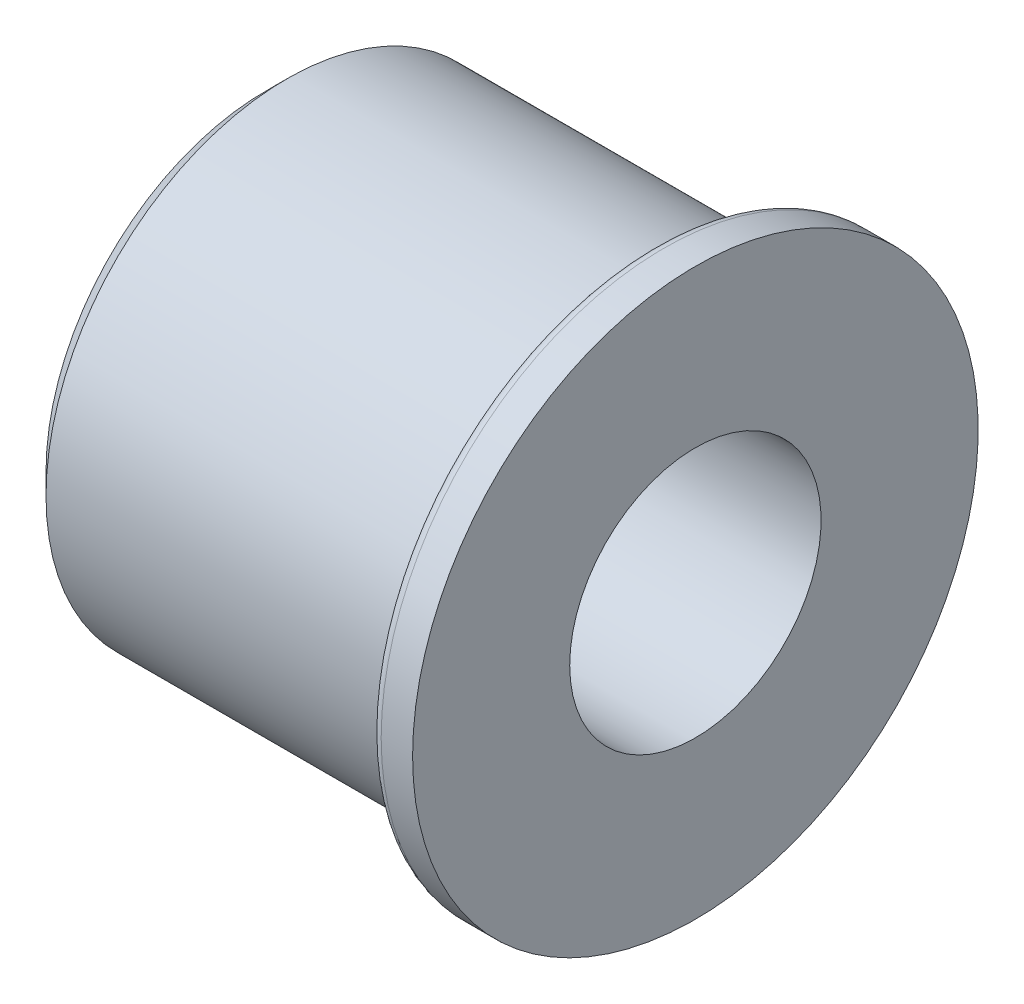
ISO-10303-21;
HEADER;
FILE_DESCRIPTION(('STEP AP214'),'2;1');
FILE_NAME('part.step','',(''),(''),'','','');
FILE_SCHEMA(('AUTOMOTIVE_DESIGN { 1 0 10303 214 1 1 1 1 }'));
ENDSEC;
DATA;
#1=APPLICATION_CONTEXT('core data for automotive mechanical design processes');
#2=APPLICATION_PROTOCOL_DEFINITION('international standard','automotive_design',2000,#1);
#3=PRODUCT_CONTEXT('',#1,'mechanical');
#4=PRODUCT('Part','Part','',(#3));
#5=PRODUCT_RELATED_PRODUCT_CATEGORY('part','',(#4));
#6=PRODUCT_DEFINITION_FORMATION('','',#4);
#7=PRODUCT_DEFINITION_CONTEXT('part definition',#1,'design');
#8=PRODUCT_DEFINITION('design','',#6,#7);
#9=PRODUCT_DEFINITION_SHAPE('','',#8);
#10=(LENGTH_UNIT() NAMED_UNIT(*) SI_UNIT(.MILLI.,.METRE.));
#11=(NAMED_UNIT(*) PLANE_ANGLE_UNIT() SI_UNIT($,.RADIAN.));
#12=(NAMED_UNIT(*) SI_UNIT($,.STERADIAN.) SOLID_ANGLE_UNIT());
#13=UNCERTAINTY_MEASURE_WITH_UNIT(LENGTH_MEASURE(1.E-05),#10,'distance_accuracy_value','');
#14=(GEOMETRIC_REPRESENTATION_CONTEXT(3) GLOBAL_UNCERTAINTY_ASSIGNED_CONTEXT((#13)) GLOBAL_UNIT_ASSIGNED_CONTEXT((#10,
#11,#12)) REPRESENTATION_CONTEXT('',''));
#15=CARTESIAN_POINT('',(0.,0.,0.));
#16=DIRECTION('',(0.,0.,1.));
#17=DIRECTION('',(1.,0.,0.));
#18=AXIS2_PLACEMENT_3D('',#15,#16,#17);
#19=CARTESIAN_POINT('',(0.,0.,0.));
#20=DIRECTION('',(-1.,0.,0.));
#21=DIRECTION('',(0.,0.,1.));
#22=AXIS2_PLACEMENT_3D('',#19,#20,#21);
#23=CYLINDRICAL_SURFACE('',#22,13.5);
#24=CARTESIAN_POINT('',(19.,0.,0.));
#25=DIRECTION('',(-1.,0.,0.));
#26=DIRECTION('',(0.,0.,1.));
#27=AXIS2_PLACEMENT_3D('',#24,#25,#26);
#28=CIRCLE('',#27,13.5);
#29=CARTESIAN_POINT('',(19.,0.,13.5));
#30=VERTEX_POINT('',#29);
#31=EDGE_CURVE('E10',#30,#30,#28,.T.);
#32=ORIENTED_EDGE('',*,*,#31,.F.);
#33=EDGE_LOOP('',(#32));
#34=FACE_BOUND('',#33,.T.);
#35=CARTESIAN_POINT('',(20.5,0.,0.));
#36=DIRECTION('',(-1.,0.,0.));
#37=DIRECTION('',(0.,0.,1.));
#38=AXIS2_PLACEMENT_3D('',#35,#36,#37);
#39=CIRCLE('',#38,13.5);
#40=CARTESIAN_POINT('',(20.5,0.,13.5));
#41=VERTEX_POINT('',#40);
#42=EDGE_CURVE('E61',#41,#41,#39,.T.);
#43=ORIENTED_EDGE('',*,*,#42,.T.);
#44=EDGE_LOOP('',(#43));
#45=FACE_BOUND('',#44,.T.);
#46=ADVANCED_FACE('F33',(#34,#45),#23,.T.);
#47=CARTESIAN_POINT('',(19.,0.,0.));
#48=DIRECTION('',(-1.,0.,0.));
#49=DIRECTION('',(0.,0.,1.));
#50=AXIS2_PLACEMENT_3D('',#47,#48,#49);
#51=TOROIDAL_SURFACE('',#50,13.,0.5);
#52=CARTESIAN_POINT('',(18.5,0.,0.));
#53=DIRECTION('',(-1.,0.,0.));
#54=DIRECTION('',(0.,0.,1.));
#55=AXIS2_PLACEMENT_3D('',#52,#53,#54);
#56=CIRCLE('',#55,13.);
#57=CARTESIAN_POINT('',(18.5,0.,13.));
#58=VERTEX_POINT('',#57);
#59=EDGE_CURVE('E39',#58,#58,#56,.T.);
#60=ORIENTED_EDGE('',*,*,#59,.F.);
#61=EDGE_LOOP('',(#60));
#62=FACE_BOUND('',#61,.T.);
#63=ORIENTED_EDGE('',*,*,#31,.T.);
#64=EDGE_LOOP('',(#63));
#65=FACE_BOUND('',#64,.T.);
#66=ADVANCED_FACE('F98',(#62,#65),#51,.T.);
#67=CARTESIAN_POINT('',(18.5,13.,0.));
#68=DIRECTION('',(1.,0.,0.));
#69=DIRECTION('',(0.,0.,-1.));
#70=AXIS2_PLACEMENT_3D('',#67,#68,#69);
#71=PLANE('',#70);
#72=CARTESIAN_POINT('',(18.5,0.,0.));
#73=DIRECTION('',(-1.,0.,0.));
#74=DIRECTION('',(0.,0.,1.));
#75=AXIS2_PLACEMENT_3D('',#72,#73,#74);
#76=CIRCLE('',#75,11.5);
#77=CARTESIAN_POINT('',(18.5,0.,11.5));
#78=VERTEX_POINT('',#77);
#79=EDGE_CURVE('E43',#78,#78,#76,.T.);
#80=ORIENTED_EDGE('',*,*,#79,.F.);
#81=EDGE_LOOP('',(#80));
#82=FACE_BOUND('',#81,.T.);
#83=ORIENTED_EDGE('',*,*,#59,.T.);
#84=EDGE_LOOP('',(#83));
#85=FACE_BOUND('',#84,.T.);
#86=ADVANCED_FACE('F93',(#82,#85),#71,.F.);
#87=CARTESIAN_POINT('',(0.,0.,0.));
#88=DIRECTION('',(-1.,0.,0.));
#89=DIRECTION('',(0.,0.,1.));
#90=AXIS2_PLACEMENT_3D('',#87,#88,#89);
#91=CYLINDRICAL_SURFACE('',#90,11.5);
#92=CARTESIAN_POINT('',(1.,0.,0.));
#93=DIRECTION('',(-1.,0.,0.));
#94=DIRECTION('',(0.,0.,1.));
#95=AXIS2_PLACEMENT_3D('',#92,#93,#94);
#96=CIRCLE('',#95,11.5);
#97=CARTESIAN_POINT('',(1.,0.,11.5));
#98=VERTEX_POINT('',#97);
#99=EDGE_CURVE('E47',#98,#98,#96,.T.);
#100=ORIENTED_EDGE('',*,*,#99,.F.);
#101=EDGE_LOOP('',(#100));
#102=FACE_BOUND('',#101,.T.);
#103=ORIENTED_EDGE('',*,*,#79,.T.);
#104=EDGE_LOOP('',(#103));
#105=FACE_BOUND('',#104,.T.);
#106=ADVANCED_FACE('F87',(#102,#105),#91,.T.);
#107=CARTESIAN_POINT('',(1.,0.,0.));
#108=DIRECTION('',(1.,0.,0.));
#109=DIRECTION('',(0.,0.,-1.));
#110=AXIS2_PLACEMENT_3D('',#107,#108,#109);
#111=CONICAL_SURFACE('',#110,11.5,0.785398163397449);
#112=CARTESIAN_POINT('',(0.,0.,0.));
#113=DIRECTION('',(-1.,0.,0.));
#114=DIRECTION('',(0.,0.,1.));
#115=AXIS2_PLACEMENT_3D('',#112,#113,#114);
#116=CIRCLE('',#115,10.5);
#117=CARTESIAN_POINT('',(0.,0.,10.5));
#118=VERTEX_POINT('',#117);
#119=EDGE_CURVE('E52',#118,#118,#116,.T.);
#120=ORIENTED_EDGE('',*,*,#119,.F.);
#121=EDGE_LOOP('',(#120));
#122=FACE_BOUND('',#121,.T.);
#123=ORIENTED_EDGE('',*,*,#99,.T.);
#124=EDGE_LOOP('',(#123));
#125=FACE_BOUND('',#124,.T.);
#126=ADVANCED_FACE('F81',(#122,#125),#111,.T.);
#127=CARTESIAN_POINT('',(0.,6.,0.));
#128=DIRECTION('',(1.,0.,0.));
#129=DIRECTION('',(0.,0.,-1.));
#130=AXIS2_PLACEMENT_3D('',#127,#128,#129);
#131=PLANE('',#130);
#132=CARTESIAN_POINT('',(0.,0.,0.));
#133=DIRECTION('',(-1.,0.,0.));
#134=DIRECTION('',(0.,0.,1.));
#135=AXIS2_PLACEMENT_3D('',#132,#133,#134);
#136=CIRCLE('',#135,6.);
#137=CARTESIAN_POINT('',(0.,0.,6.));
#138=VERTEX_POINT('',#137);
#139=EDGE_CURVE('E55',#138,#138,#136,.T.);
#140=ORIENTED_EDGE('',*,*,#139,.F.);
#141=EDGE_LOOP('',(#140));
#142=FACE_BOUND('',#141,.T.);
#143=ORIENTED_EDGE('',*,*,#119,.T.);
#144=EDGE_LOOP('',(#143));
#145=FACE_BOUND('',#144,.T.);
#146=ADVANCED_FACE('F75',(#142,#145),#131,.F.);
#147=CARTESIAN_POINT('',(0.,0.,0.));
#148=DIRECTION('',(-1.,0.,0.));
#149=DIRECTION('',(0.,0.,1.));
#150=AXIS2_PLACEMENT_3D('',#147,#148,#149);
#151=CYLINDRICAL_SURFACE('',#150,6.);
#152=CARTESIAN_POINT('',(20.5,0.,0.));
#153=DIRECTION('',(-1.,0.,0.));
#154=DIRECTION('',(0.,0.,1.));
#155=AXIS2_PLACEMENT_3D('',#152,#153,#154);
#156=CIRCLE('',#155,6.);
#157=CARTESIAN_POINT('',(20.5,0.,6.));
#158=VERTEX_POINT('',#157);
#159=EDGE_CURVE('E58',#158,#158,#156,.T.);
#160=ORIENTED_EDGE('',*,*,#159,.F.);
#161=EDGE_LOOP('',(#160));
#162=FACE_BOUND('',#161,.T.);
#163=ORIENTED_EDGE('',*,*,#139,.T.);
#164=EDGE_LOOP('',(#163));
#165=FACE_BOUND('',#164,.T.);
#166=ADVANCED_FACE('F69',(#162,#165),#151,.F.);
#167=CARTESIAN_POINT('',(20.5,6.,0.));
#168=DIRECTION('',(-1.,0.,0.));
#169=DIRECTION('',(0.,0.,1.));
#170=AXIS2_PLACEMENT_3D('',#167,#168,#169);
#171=PLANE('',#170);
#172=ORIENTED_EDGE('',*,*,#42,.F.);
#173=EDGE_LOOP('',(#172));
#174=FACE_BOUND('',#173,.T.);
#175=ORIENTED_EDGE('',*,*,#159,.T.);
#176=EDGE_LOOP('',(#175));
#177=FACE_BOUND('',#176,.T.);
#178=ADVANCED_FACE('F66',(#174,#177),#171,.F.);
#179=CLOSED_SHELL('',(#46,#66,#86,#106,#126,#146,#166,#178));
#180=MANIFOLD_SOLID_BREP('B2',#179);
#181=ADVANCED_BREP_SHAPE_REPRESENTATION('',(#18,#180),#14);
#182=SHAPE_DEFINITION_REPRESENTATION(#9,#181);
ENDSEC;
END-ISO-10303-21;
